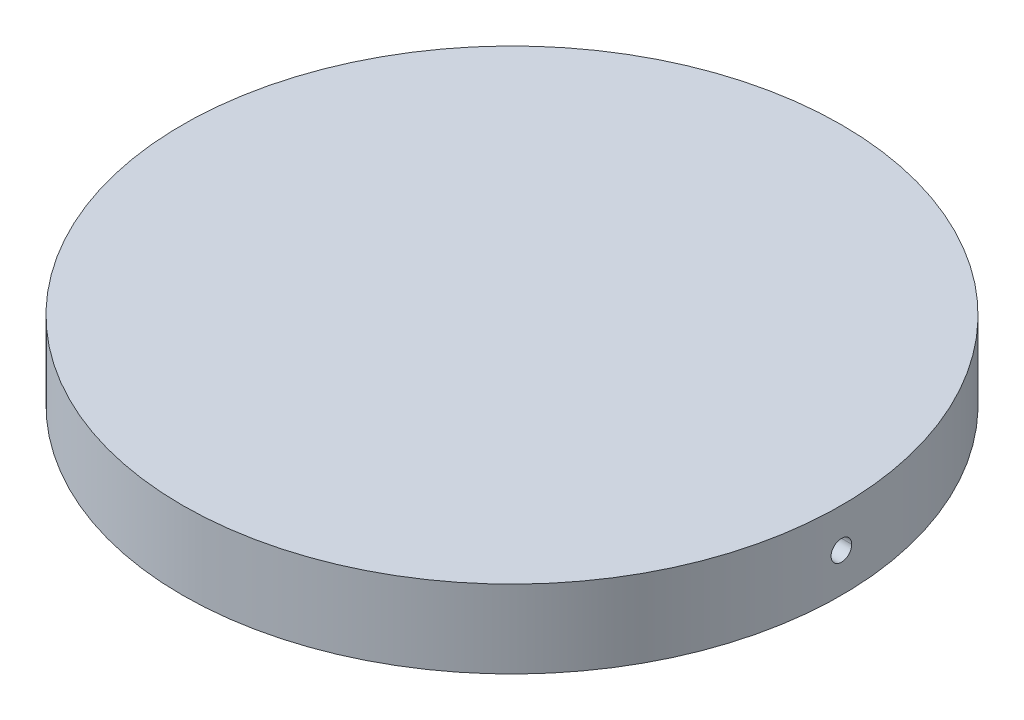
ISO-10303-21;
HEADER;
FILE_DESCRIPTION(('STEP AP214'),'2;1');
FILE_NAME('part.step','',(''),(''),'','','');
FILE_SCHEMA(('AUTOMOTIVE_DESIGN { 1 0 10303 214 1 1 1 1 }'));
ENDSEC;
DATA;
#1=APPLICATION_CONTEXT('core data for automotive mechanical design processes');
#2=APPLICATION_PROTOCOL_DEFINITION('international standard','automotive_design',2000,#1);
#3=PRODUCT_CONTEXT('',#1,'mechanical');
#4=PRODUCT('Part','Part','',(#3));
#5=PRODUCT_RELATED_PRODUCT_CATEGORY('part','',(#4));
#6=PRODUCT_DEFINITION_FORMATION('','',#4);
#7=PRODUCT_DEFINITION_CONTEXT('part definition',#1,'design');
#8=PRODUCT_DEFINITION('design','',#6,#7);
#9=PRODUCT_DEFINITION_SHAPE('','',#8);
#10=(LENGTH_UNIT() NAMED_UNIT(*) SI_UNIT(.MILLI.,.METRE.));
#11=(NAMED_UNIT(*) PLANE_ANGLE_UNIT() SI_UNIT($,.RADIAN.));
#12=(NAMED_UNIT(*) SI_UNIT($,.STERADIAN.) SOLID_ANGLE_UNIT());
#13=UNCERTAINTY_MEASURE_WITH_UNIT(LENGTH_MEASURE(1.E-05),#10,'distance_accuracy_value','');
#14=(GEOMETRIC_REPRESENTATION_CONTEXT(3) GLOBAL_UNCERTAINTY_ASSIGNED_CONTEXT((#13)) GLOBAL_UNIT_ASSIGNED_CONTEXT((#10,
#11,#12)) REPRESENTATION_CONTEXT('',''));
#15=CARTESIAN_POINT('',(0.,0.,0.));
#16=DIRECTION('',(0.,0.,1.));
#17=DIRECTION('',(1.,0.,0.));
#18=AXIS2_PLACEMENT_3D('',#15,#16,#17);
#19=CARTESIAN_POINT('',(12.7,7.606551128,0.));
#20=DIRECTION('',(0.,-1.,0.));
#21=DIRECTION('',(1.,0.,0.));
#22=AXIS2_PLACEMENT_3D('',#19,#20,#21);
#23=CYLINDRICAL_SURFACE('',#22,50.8);
#24=CARTESIAN_POINT('',(-38.0751909290542,6.00056940736033,1.58744641424879));
#25=CARTESIAN_POINT('',(-38.0751900585185,5.95591924779418,1.58746340135656));
#26=CARTESIAN_POINT('',(-38.075248819807,5.91128976092665,1.58559597276022));
#27=CARTESIAN_POINT('',(-38.0754821181188,5.82234888457599,1.57811165859868));
#28=CARTESIAN_POINT('',(-38.0756566493904,5.77803747940012,1.57249495930881));
#29=CARTESIAN_POINT('',(-38.0763479300891,5.64613110276851,1.55007392236804));
#30=CARTESIAN_POINT('',(-38.0770323867037,5.55941785487588,1.52769855641127));
#31=CARTESIAN_POINT('',(-38.0787725083873,5.39098483822894,1.46871464950783));
#32=CARTESIAN_POINT('',(-38.0798283424716,5.30926736297704,1.43209962724265));
#33=CARTESIAN_POINT('',(-38.0821917895835,5.15314259667142,1.34568129167991));
#34=CARTESIAN_POINT('',(-38.0834993550029,5.07873392736502,1.29588047145552));
#35=CARTESIAN_POINT('',(-38.0862195509659,4.93930995514943,1.18448267866127));
#36=CARTESIAN_POINT('',(-38.0876322156291,4.87429772304661,1.12288186501475));
#37=CARTESIAN_POINT('',(-38.090403260518,4.75552522391951,0.989630573851511));
#38=CARTESIAN_POINT('',(-38.0917616324457,4.7017666716213,0.917978567605816));
#39=CARTESIAN_POINT('',(-38.0942709801728,4.60703300606265,0.766651369601128));
#40=CARTESIAN_POINT('',(-38.0954219224862,4.56605995602277,0.686974885658298));
#41=CARTESIAN_POINT('',(-38.0973862993972,4.49807583188354,0.521874813353642));
#42=CARTESIAN_POINT('',(-38.0981997562586,4.47106383674918,0.436451604533537));
#43=CARTESIAN_POINT('',(-38.0993973470415,4.43177291796812,0.262306464328654));
#44=CARTESIAN_POINT('',(-38.0997816140124,4.41948942838551,0.173585564048473));
#45=CARTESIAN_POINT('',(-38.1000779568643,4.40999005613285,-0.00466197737175226));
#46=CARTESIAN_POINT('',(-38.0999900230184,4.41277448385107,-0.0941886350718949));
#47=CARTESIAN_POINT('',(-38.0993519704751,4.43332858800722,-0.271470343358425));
#48=CARTESIAN_POINT('',(-38.098802018006,4.45109287489788,-0.359226019493863));
#49=CARTESIAN_POINT('',(-38.097302101488,4.50109403484533,-0.530508627312229));
#50=CARTESIAN_POINT('',(-38.096352138269,4.53333087787783,-0.614035567767554));
#51=CARTESIAN_POINT('',(-38.0941589542333,4.61136893559563,-0.77450898229184));
#52=CARTESIAN_POINT('',(-38.0929156740951,4.65717289462597,-0.851454120937065));
#53=CARTESIAN_POINT('',(-38.0902760474102,4.76104074561996,-0.996560943308238));
#54=CARTESIAN_POINT('',(-38.0888797078499,4.81910407812122,-1.06472302762459));
#55=CARTESIAN_POINT('',(-38.0860907401809,4.94586339646807,-1.19035534964623));
#56=CARTESIAN_POINT('',(-38.0846981132851,5.01456250595847,-1.24782243535993));
#57=CARTESIAN_POINT('',(-38.0820735344925,5.16066240553603,-1.35042640851576));
#58=CARTESIAN_POINT('',(-38.0808416333816,5.23806593172353,-1.39555940354725));
#59=CARTESIAN_POINT('',(-38.078677319693,5.39938913015483,-1.47221151271816));
#60=CARTESIAN_POINT('',(-38.0777450922014,5.48331278982382,-1.50372221751249));
#61=CARTESIAN_POINT('',(-38.0762878194112,5.65519786341699,-1.55215727164181));
#62=CARTESIAN_POINT('',(-38.0757621546945,5.74315291786559,-1.56910381458254));
#63=CARTESIAN_POINT('',(-38.0753755396687,5.85974734480052,-1.58153135898569));
#64=CARTESIAN_POINT('',(-38.0753058895327,5.88777547495679,-1.58376531958047));
#65=CARTESIAN_POINT('',(-38.0752130507354,5.94386437461089,-1.58673983982125));
#66=CARTESIAN_POINT('',(-38.0751897852135,5.97192501289248,-1.58748286999909));
#67=CARTESIAN_POINT('',(-38.0751897623787,5.99999729523695,-1.58748373044656));
#68=B_SPLINE_CURVE_WITH_KNOTS('',3,(#24,#25,#26,#27,#28,#29,#30,#31,#32,#33,#34,#35,#36,#37,#38,
#39,#40,#41,#42,#43,#44,#45,#46,#47,#48,#49,#50,#51,#52,#53,#54,#55,#56,#57,#58,#59,#60,#61,#62,
#63,#64,#65,#66,#67),.UNSPECIFIED.,.F.,.F.,(4,2,2,2,2,2,2,2,2,2,2,2,2,2,2,2,2,2,2,2,2,4),(0.,
0.133868178796989,0.267729707105143,0.535019999168647,0.802432093673216,1.06979366393697,
1.33724241279178,1.60473188326651,1.87226449672452,2.13977945833837,2.4072114670535,
2.67464898469677,2.94199032303325,3.20933110675468,3.47672600492289,3.74410870303281,
4.01157007885107,4.27911576331213,4.54682637468985,4.81412830807478,4.8984518156345,
4.98263547996859),.UNSPECIFIED.);
#69=CARTESIAN_POINT('',(-38.0751949719159,6.00056940833788,1.58744906791431));
#70=VERTEX_POINT('',#69);
#71=CARTESIAN_POINT('',(-38.0751894837319,5.99999729486621,-1.58748400761627));
#72=VERTEX_POINT('',#71);
#73=EDGE_CURVE('E121',#70,#72,#68,.T.);
#74=ORIENTED_EDGE('',*,*,#73,.F.);
#75=CARTESIAN_POINT('',(-38.0751897453393,5.99999729485935,-1.58748427544658));
#76=CARTESIAN_POINT('',(-38.0751893778954,6.04464758712235,-1.58748517092355));
#77=CARTESIAN_POINT('',(-38.075248643629,6.08927652677053,-1.58560165210028));
#78=CARTESIAN_POINT('',(-38.0754829397681,6.1782149549185,-1.57808526043562));
#79=CARTESIAN_POINT('',(-38.075657964422,6.22252445917907,-1.57245257387406));
#80=CARTESIAN_POINT('',(-38.076350686543,6.35442312033707,-1.5499839286689));
#81=CARTESIAN_POINT('',(-38.0770360541879,6.44112854119426,-1.52757724260858));
#82=CARTESIAN_POINT('',(-38.0787777955324,6.6095407552495,-1.46853245353917));
#83=CARTESIAN_POINT('',(-38.0798343381506,6.69124525265819,-1.43188787018034));
#84=CARTESIAN_POINT('',(-38.0821989221843,6.84733928844364,-1.34541300730348));
#85=CARTESIAN_POINT('',(-38.0835069160451,6.92173020595897,-1.29558522033912));
#86=CARTESIAN_POINT('',(-38.0862276435986,7.06111440264217,-1.18413683616334));
#87=CARTESIAN_POINT('',(-38.0876404113152,7.12610460867162,-1.12251239779638));
#88=CARTESIAN_POINT('',(-38.0904113284325,7.24482939587818,-0.989217877335405));
#89=CARTESIAN_POINT('',(-38.0917694694845,7.29856226182281,-0.917546267169794));
#90=CARTESIAN_POINT('',(-38.0942780506316,7.3932415916547,-0.766184482696691));
#91=CARTESIAN_POINT('',(-38.0954284573034,7.43418599872302,-0.686493021246849));
#92=CARTESIAN_POINT('',(-38.097391523819,7.50211072900084,-0.521368016468653));
#93=CARTESIAN_POINT('',(-38.0982042059428,7.52909197340155,-0.4359348523577));
#94=CARTESIAN_POINT('',(-38.0994001002624,7.56832015610289,-0.261775146878376));
#95=CARTESIAN_POINT('',(-38.0997834457251,7.58057166662578,-0.173049636299685));
#96=CARTESIAN_POINT('',(-38.1000779078492,7.59000676671905,0.00520168582282082));
#97=CARTESIAN_POINT('',(-38.0999890147897,7.58719004611181,0.0947275138031959));
#98=CARTESIAN_POINT('',(-38.0993491195269,7.56657197154118,0.272002179810747));
#99=CARTESIAN_POINT('',(-38.0987982833791,7.54877600218782,0.359751644783529));
#100=CARTESIAN_POINT('',(-38.0972967789571,7.49871297187023,0.531016611016644));
#101=CARTESIAN_POINT('',(-38.096346111469,7.46644593936263,0.614532120602485));
#102=CARTESIAN_POINT('',(-38.0941517812862,7.38834981608639,0.774977830946134));
#103=CARTESIAN_POINT('',(-38.092908059102,7.34251797121073,0.851906690302023));
#104=CARTESIAN_POINT('',(-38.0902678662238,7.23859749287618,0.996976467194709));
#105=CARTESIAN_POINT('',(-38.0888714025784,7.18050942488942,1.06511778993333));
#106=CARTESIAN_POINT('',(-38.0860825232696,7.05370451982573,1.19070466934683));
#107=CARTESIAN_POINT('',(-38.0846901089137,6.98498456991688,1.24814708267525));
#108=CARTESIAN_POINT('',(-38.0820662671471,6.83884725502513,1.35069867120581));
#109=CARTESIAN_POINT('',(-38.0808348909561,6.76142713735432,1.39580392740717));
#110=CARTESIAN_POINT('',(-38.0786718846783,6.60007551237815,1.47239820947198));
#111=CARTESIAN_POINT('',(-38.0777404404887,6.51614000668513,1.50387879492999));
#112=CARTESIAN_POINT('',(-38.0762849129933,6.34423692431069,1.5522518582151));
#113=CARTESIAN_POINT('',(-38.0757602069073,6.25627573119067,1.56916664299605));
#114=CARTESIAN_POINT('',(-38.075375521643,6.13986715676128,1.58153189666837));
#115=CARTESIAN_POINT('',(-38.0753065021592,6.11202913252193,1.58374566298647));
#116=CARTESIAN_POINT('',(-38.0752142954912,6.05632105275694,1.58670000430366));
#117=CARTESIAN_POINT('',(-38.0751910327289,6.02845112625979,1.5874430086269));
#118=CARTESIAN_POINT('',(-38.0751906945965,6.0005694100009,1.58745391346005));
#119=B_SPLINE_CURVE_WITH_KNOTS('',3,(#75,#76,#77,#78,#79,#80,#81,#82,#83,#84,#85,#86,#87,#88,
#89,#90,#91,#92,#93,#94,#95,#96,#97,#98,#99,#100,#101,#102,#103,#104,#105,#106,#107,#108,#109,
#110,#111,#112,#113,#114,#115,#116,#117,#118),.UNSPECIFIED.,.F.,.F.,(4,2,2,2,2,2,2,2,2,2,2,2,2,
2,2,2,2,2,2,2,2,4),(0.,0.133868566856858,0.267730482863573,0.535021549459192,0.802434415817713,
1.06979675840348,1.33724630646569,1.60473657507669,1.87226984308955,2.13978545888933,
2.40721801433531,2.67465607486766,2.94199804012864,3.20933947967695,3.47673523568703,
3.7441186574079,4.01158051305785,4.27912723178262,4.54683945774685,4.81414096003585,
4.89789181972344,4.98150422850908),.UNSPECIFIED.);
#120=EDGE_CURVE('E123',#72,#70,#119,.T.);
#121=ORIENTED_EDGE('',*,*,#120,.F.);
#122=EDGE_LOOP('',(#74,#121));
#123=FACE_BOUND('',#122,.T.);
#124=ADVANCED_FACE('F17',(#123),#23,.T.);
#125=CARTESIAN_POINT('',(-12.7,7.6065612056119,0.));
#126=DIRECTION('',(0.,-1.,0.));
#127=DIRECTION('',(0.,0.,-1.));
#128=AXIS2_PLACEMENT_3D('',#125,#126,#127);
#129=CYLINDRICAL_SURFACE('',#128,50.8);
#130=CARTESIAN_POINT('',(38.0751897560507,6.00002217674057,1.58748393284521));
#131=CARTESIAN_POINT('',(38.0751894059754,6.0446723551502,1.58748427285173));
#132=CARTESIAN_POINT('',(38.0752486889027,6.08930115753162,1.58560020360341));
#133=CARTESIAN_POINT('',(38.0754830186217,6.17823926526298,1.57808272458439));
#134=CARTESIAN_POINT('',(38.0756580596619,6.22254858637603,1.57244950109318));
#135=CARTESIAN_POINT('',(38.0763508289955,6.35444663128025,1.54997927208544));
#136=CARTESIAN_POINT('',(38.0770362255796,6.4411515519084,1.52757156432102));
#137=CARTESIAN_POINT('',(38.0787780165634,6.60956260106108,1.46852483027927));
#138=CARTESIAN_POINT('',(38.0798345798779,6.69126643372268,1.43187932370077));
#139=CARTESIAN_POINT('',(38.082199194964,6.84735899463586,1.34540273890996));
#140=CARTESIAN_POINT('',(38.0835071991831,6.92174910204908,1.29557415321978));
#141=CARTESIAN_POINT('',(38.0862279362621,7.06113155593076,1.18412431826789));
#142=CARTESIAN_POINT('',(38.0876407031425,7.12612082919434,1.12249922786549));
#143=CARTESIAN_POINT('',(38.0904116078575,7.24484365434318,0.989203568816823));
#144=CARTESIAN_POINT('',(38.0917697373419,7.29857549099116,0.917531472132948));
#145=CARTESIAN_POINT('',(38.0942782863401,7.39325269393727,0.766168895365366));
#146=CARTESIAN_POINT('',(38.0954286724328,7.43419600362852,0.686477128307655));
#147=CARTESIAN_POINT('',(38.0973916916178,7.5021185033926,0.521351701013395));
#148=CARTESIAN_POINT('',(38.0982043469909,7.52909861467347,0.435918419987761));
#149=CARTESIAN_POINT('',(38.0994001851789,7.56832452751365,0.261758674465493));
#150=CARTESIAN_POINT('',(38.09978350127,7.58057490158915,0.173033240764935));
#151=CARTESIAN_POINT('',(38.1000779059064,7.59000775821689,-0.00521773924232872));
#152=CARTESIAN_POINT('',(38.099988984723,7.58718993034246,-0.094743301994911));
#153=CARTESIAN_POINT('',(38.0993490381657,7.5665697014185,-0.272017260463798));
#154=CARTESIAN_POINT('',(38.0987981788196,7.54877268411676,-0.35976628309328));
#155=CARTESIAN_POINT('',(38.0972966361458,7.49870764901997,-0.531030185999936));
#156=CARTESIAN_POINT('',(38.0963459536454,7.46643966116265,-0.614545075036342));
#157=CARTESIAN_POINT('',(38.0941516039746,7.38834175210409,-0.774989378856817));
#158=CARTESIAN_POINT('',(38.0929078773693,7.34250907923369,-0.851917453383995));
#159=CARTESIAN_POINT('',(38.0902676863655,7.23858706641015,-0.996985570898472));
#160=CARTESIAN_POINT('',(38.08887122894,7.18049828588885,-1.06512601476981));
#161=CARTESIAN_POINT('',(38.0860823719871,7.05369205755473,-1.19071107497247));
#162=CARTESIAN_POINT('',(38.0846899737741,6.98497148881081,-1.24815253970182));
#163=CARTESIAN_POINT('',(38.0820661769658,6.83883326038768,-1.35070202003112));
#164=CARTESIAN_POINT('',(38.0808348292639,6.76141286578344,-1.39580614180721));
#165=CARTESIAN_POINT('',(38.0786718886263,6.60006105466413,-1.47239803971517));
#166=CARTESIAN_POINT('',(38.0777404807633,6.51612565766241,-1.50387741303477));
#167=CARTESIAN_POINT('',(38.0762850213733,6.34422256550315,-1.55224830043223));
#168=CARTESIAN_POINT('',(38.0757603501067,6.25626122208779,-1.56916201240498));
#169=CARTESIAN_POINT('',(38.0753750928506,6.13966559192947,-1.58154568340952));
#170=CARTESIAN_POINT('',(38.0753057742402,6.1116400346466,-1.58376900560969));
#171=CARTESIAN_POINT('',(38.0752135892311,6.05555683981397,-1.58672259866644));
#172=CARTESIAN_POINT('',(38.0751906459902,6.02749933253496,-1.58745533937061));
#173=CARTESIAN_POINT('',(38.0751909393071,5.99943045091416,-1.58744608629906));
#174=B_SPLINE_CURVE_WITH_KNOTS('',3,(#130,#131,#132,#133,#134,#135,#136,#137,#138,#139,#140,
#141,#142,#143,#144,#145,#146,#147,#148,#149,#150,#151,#152,#153,#154,#155,#156,#157,#158,#159,
#160,#161,#162,#163,#164,#165,#166,#167,#168,#169,#170,#171,#172,#173),.UNSPECIFIED.,.F.,.F.,(4,
2,2,2,2,2,2,2,2,2,2,2,2,2,2,2,2,2,2,2,2,4),(0.,0.133868225479692,0.267729800114867,
0.53502018488514,0.802432369041878,1.0697940297174,1.33724289639863,1.60473248329037,
1.8722650648147,2.13977999389396,2.40721185751217,2.674649230633,2.94199052373312,
3.20933126375666,3.47672627249857,3.74410907859536,4.01157052360165,4.27911628572769,
4.54682681745968,4.81412863584237,4.89844192904701,4.98261540355422),.UNSPECIFIED.);
#175=CARTESIAN_POINT('',(38.0751898227204,6.00002217673813,1.5874841095571));
#176=VERTEX_POINT('',#175);
#177=CARTESIAN_POINT('',(38.0751948252608,5.99943044989101,-1.58744885417735));
#178=VERTEX_POINT('',#177);
#179=EDGE_CURVE('E86',#176,#178,#174,.T.);
#180=ORIENTED_EDGE('',*,*,#179,.F.);
#181=CARTESIAN_POINT('',(38.0751906952858,5.99943044816505,-1.5874538914131));
#182=CARTESIAN_POINT('',(38.0751908310659,5.95478014053231,-1.58743869120175));
#183=CARTESIAN_POINT('',(38.0752505986689,5.91015186554544,-1.58553908300143));
#184=CARTESIAN_POINT('',(38.0754858821087,5.82121611997089,-1.57799062531259));
#185=CARTESIAN_POINT('',(38.0756613921943,5.77690863355442,-1.57234196210747));
#186=CARTESIAN_POINT('',(38.0763555239195,5.64501803636058,-1.54982575507474));
#187=CARTESIAN_POINT('',(38.0770417707606,5.55832067226077,-1.52738779925939));
#188=CARTESIAN_POINT('',(38.0787850480427,5.38992970830517,-1.46828226595392));
#189=CARTESIAN_POINT('',(38.0798422472968,5.30823840652385,-1.43160820908926));
#190=CARTESIAN_POINT('',(38.0822078463666,5.1521755189868,-1.34507702866756));
#191=CARTESIAN_POINT('',(38.0835161986844,5.07780255321015,-1.29522239713788));
#192=CARTESIAN_POINT('',(38.0862373022913,4.93845851059335,-1.18372369848512));
#193=CARTESIAN_POINT('',(38.0876500875006,4.87349050898379,-1.12207579042969));
#194=CARTESIAN_POINT('',(38.0904206932689,4.75481376207026,-0.988738378256718));
#195=CARTESIAN_POINT('',(38.0917785054267,4.70110673249107,-0.917047346737802));
#196=CARTESIAN_POINT('',(38.0942861148692,4.60648200757359,-0.765651366165082));
#197=CARTESIAN_POINT('',(38.0954358787993,4.56556636220237,-0.685945135285433));
#198=CARTESIAN_POINT('',(38.0973974153094,4.49770122648831,-0.520795631663674));
#199=CARTESIAN_POINT('',(38.0982092101862,4.47075081478556,-0.435352737819623));
#200=CARTESIAN_POINT('',(38.0994031812412,4.43158549293618,-0.261178930221962));
#201=CARTESIAN_POINT('',(38.0997854909092,4.41936600413079,-0.172449046971713));
#202=CARTESIAN_POINT('',(38.1000778453874,4.40999522027072,0.00580557774714265));
#203=CARTESIAN_POINT('',(38.0999878804745,4.41284423544171,0.0953303355425001));
#204=CARTESIAN_POINT('',(38.0993459220469,4.43352624363747,0.272597487805323));
#205=CARTESIAN_POINT('',(38.0987940943787,4.4513538581317,0.360340510478826));
#206=CARTESIAN_POINT('',(38.0972907940262,4.50147864357114,0.531587372707447));
#207=CARTESIAN_POINT('',(38.0963393221269,4.53377578609576,0.615091220588656));
#208=CARTESIAN_POINT('',(38.0941436557269,4.61192977109221,0.775508768541391));
#209=CARTESIAN_POINT('',(38.0928994016205,4.65778937514814,0.852421122337199));
#210=CARTESIAN_POINT('',(38.0902584741661,4.76176221399162,0.997453464972865));
#211=CARTESIAN_POINT('',(38.0888618078503,4.81987488354603,1.06557385915167));
#212=CARTESIAN_POINT('',(38.0860728721197,4.94672513969897,1.19111503517263));
#213=CARTESIAN_POINT('',(38.0846806041144,5.01546583688191,1.24853267367297));
#214=CARTESIAN_POINT('',(38.0820573851221,5.16164020347839,1.35103156525602));
#215=CARTESIAN_POINT('',(38.0808264854532,5.23907662382656,1.3961088988304));
#216=CARTESIAN_POINT('',(38.0786647074695,5.4004558913762,1.47264494957715));
#217=CARTESIAN_POINT('',(38.0777340150144,5.48440272947291,1.50409523429866));
#218=CARTESIAN_POINT('',(38.0762801780606,5.65632321528267,1.55240625229145));
#219=CARTESIAN_POINT('',(38.075756410545,5.74429048803016,1.56928929294073));
#220=CARTESIAN_POINT('',(38.0753729987804,5.86070662293988,1.58161287259628));
#221=CARTESIAN_POINT('',(38.0753042842252,5.888548579945,1.58381675938191));
#222=CARTESIAN_POINT('',(38.0752127016156,5.94426399415675,1.58675099919404));
#223=CARTESIAN_POINT('',(38.0751897579548,5.97213732319088,1.58748378227095));
#224=CARTESIAN_POINT('',(38.0751897446713,6.00002217083787,1.58748429681317));
#225=B_SPLINE_CURVE_WITH_KNOTS('',3,(#181,#182,#183,#184,#185,#186,#187,#188,#189,#190,#191,
#192,#193,#194,#195,#196,#197,#198,#199,#200,#201,#202,#203,#204,#205,#206,#207,#208,#209,#210,
#211,#212,#213,#214,#215,#216,#217,#218,#219,#220,#221,#222,#223,#224),.UNSPECIFIED.,.F.,.F.,(4,
2,2,2,2,2,2,2,2,2,2,2,2,2,2,2,2,2,2,2,2,4),(0.,0.13386862056266,0.26773058994721,
0.535021763727859,0.802434734486708,1.06979718207244,1.33724685518951,1.60473724744916,
1.87227048618449,2.13978607209711,2.40721848748111,2.6746564087022,2.9419983390669,
3.20933974432951,3.47673562308801,3.74411916958894,4.01158112189449,4.27912792674466,
4.54684005458097,4.81414149329203,4.89790175676134,4.98152354617611),.UNSPECIFIED.);
#226=EDGE_CURVE('E195',#178,#176,#225,.T.);
#227=ORIENTED_EDGE('',*,*,#226,.F.);
#228=EDGE_LOOP('',(#180,#227));
#229=FACE_BOUND('',#228,.T.);
#230=ADVANCED_FACE('F127',(#229),#129,.T.);
#231=CARTESIAN_POINT('',(-50.876353679459,6.000039213,-1.5137000000014E-05));
#232=DIRECTION('',(1.,0.,0.));
#233=DIRECTION('',(0.,0.,-1.));
#234=AXIS2_PLACEMENT_3D('',#231,#232,#233);
#235=CYLINDRICAL_SURFACE('',#234,1.587469139);
#236=ORIENTED_EDGE('',*,*,#120,.T.);
#237=CARTESIAN_POINT('',(-38.0751947530953,6.00118342825574,1.58745358963648));
#238=DIRECTION('',(-1.,0.,0.));
#239=VECTOR('',#238,1.);
#240=LINE('',#237,#239);
#241=CARTESIAN_POINT('',(-50.7751915389103,6.00118342737413,1.58745005109841));
#242=VERTEX_POINT('',#241);
#243=EDGE_CURVE('E180',#70,#242,#240,.T.);
#244=ORIENTED_EDGE('',*,*,#243,.T.);
#245=CARTESIAN_POINT('',(-50.7751893403756,6.00118342895956,1.58745218197116));
#246=CARTESIAN_POINT('',(-50.7751908775814,6.04583380186475,1.58742060258737));
#247=CARTESIAN_POINT('',(-50.7752515499253,6.09046139123707,1.58550410850129));
#248=CARTESIAN_POINT('',(-50.7754881727988,6.17939427463164,1.57792152990007));
#249=CARTESIAN_POINT('',(-50.7756641175505,6.22369958469516,1.57225563331825));
#250=CARTESIAN_POINT('',(-50.7763596315567,6.35558146328945,1.5496882578076));
#251=CARTESIAN_POINT('',(-50.7770469054495,6.44227013431349,1.5272168412393));
#252=CARTESIAN_POINT('',(-50.7787919181048,6.61063823321062,1.46804622518507));
#253=CARTESIAN_POINT('',(-50.7798498256611,6.6923153587802,1.43134054232697));
#254=CARTESIAN_POINT('',(-50.7822165537261,6.84834480705923,1.3447489530742));
#255=CARTESIAN_POINT('',(-50.7835253268315,6.92269850958222,1.29486553605626));
#256=CARTESIAN_POINT('',(-50.7862469074593,7.0619994651063,1.18331288132641));
#257=CARTESIAN_POINT('',(-50.7876597487897,7.1269436407802,1.12163980310529));
#258=CARTESIAN_POINT('',(-50.7904301033412,7.24556883657843,0.988256400541319));
#259=CARTESIAN_POINT('',(-50.7917876081107,7.29924814134858,0.916544550315659));
#260=CARTESIAN_POINT('',(-50.7942942709055,7.39381427649412,0.765111914954701));
#261=CARTESIAN_POINT('',(-50.7954433956424,7.43469906372433,0.685389853358367));
#262=CARTESIAN_POINT('',(-50.7974033954959,7.50250026476896,0.520214092997321));
#263=CARTESIAN_POINT('',(-50.7982142929171,7.52941759970517,0.434760772615933));
#264=CARTESIAN_POINT('',(-50.7994063117745,7.56851548710387,0.260571858907449));
#265=CARTESIAN_POINT('',(-50.7997875669402,7.58070062516268,0.171837295779028));
#266=CARTESIAN_POINT('',(-50.8000777745015,7.590002416216,-0.00642084884914089));
#267=CARTESIAN_POINT('',(-50.7999867171806,7.58711875921681,-0.0959444465430051));
#268=CARTESIAN_POINT('',(-50.7993426594647,7.56636817268168,-0.273203511980625));
#269=CARTESIAN_POINT('',(-50.7987898247083,7.54850661568298,-0.360939609339513));
#270=CARTESIAN_POINT('',(-50.7972847083868,7.49831559302075,-0.532167028509511));
#271=CARTESIAN_POINT('',(-50.7963324275805,7.46598615484034,-0.615658358383623));
#272=CARTESIAN_POINT('',(-50.794135431623,7.38777010545327,-0.77604568756872));
#273=CARTESIAN_POINT('',(-50.7928906567135,7.34188072336538,-0.852940334745098));
#274=CARTESIAN_POINT('',(-50.7902490356879,7.23785172886103,-0.997932497151092));
#275=CARTESIAN_POINT('',(-50.7888521966304,7.17971268494477,-1.06603042039542));
#276=CARTESIAN_POINT('',(-50.7860632835141,7.05281384844627,-1.19152250421847));
#277=CARTESIAN_POINT('',(-50.7846712109694,6.98405095253422,-1.24891352635972));
#278=CARTESIAN_POINT('',(-50.7820487270734,6.83783686933551,-1.35135588925138));
#279=CARTESIAN_POINT('',(-50.7808183673358,6.76038292268437,-1.39640329525253));
#280=CARTESIAN_POINT('',(-50.7786579544044,6.59897382141841,-1.47287697373439));
#281=CARTESIAN_POINT('',(-50.7777280875083,6.51501467358198,-1.50429480035302));
#282=CARTESIAN_POINT('',(-50.7762760971423,6.34307545760019,-1.55253920374267));
#283=CARTESIAN_POINT('',(-50.77575334864,6.25510177352756,-1.56938815193085));
#284=CARTESIAN_POINT('',(-50.7753716690745,6.13878645661255,-1.58165552824304));
#285=CARTESIAN_POINT('',(-50.7753034621147,6.11104940657377,-1.58384310163776));
#286=CARTESIAN_POINT('',(-50.7752125499997,6.05554441002121,-1.58675584436662));
#287=CARTESIAN_POINT('',(-50.7751897699406,6.02777659003258,-1.58748342109032));
#288=CARTESIAN_POINT('',(-50.7751897453393,5.99999730799729,-1.58748427544691));
#289=B_SPLINE_CURVE_WITH_KNOTS('',3,(#245,#246,#247,#248,#249,#250,#251,#252,#253,#254,#255,
#256,#257,#258,#259,#260,#261,#262,#263,#264,#265,#266,#267,#268,#269,#270,#271,#272,#273,#274,
#275,#276,#277,#278,#279,#280,#281,#282,#283,#284,#285,#286,#287,#288),.UNSPECIFIED.,.F.,.F.,(4,
2,2,2,2,2,2,2,2,2,2,2,2,2,2,2,2,2,2,2,2,4),(0.,0.133868732857255,0.267730756248488,
0.53502192304175,0.802434977913951,1.0697975524544,1.33724736983897,1.60473788354443,
1.87227109080187,2.13978665260845,2.40721892510903,2.67465669922039,2.94199858505007,
3.20933996304074,3.47673600822504,3.74411964643529,4.01158153817935,4.27912858928194,
4.54684119567118,4.81414197895249,4.89758501476171,4.98089034785674),.UNSPECIFIED.);
#290=CARTESIAN_POINT('',(-50.7751897545316,5.99999729383268,-1.58748399776918));
#291=VERTEX_POINT('',#290);
#292=EDGE_CURVE('E73',#242,#291,#289,.T.);
#293=ORIENTED_EDGE('',*,*,#292,.T.);
#294=DIRECTION('',(1.,0.,0.));
#295=VECTOR('',#294,1.);
#296=CARTESIAN_POINT('',(-50.8763519802995,5.99995537700001,-1.587483731));
#297=LINE('',#296,#295);
#298=EDGE_CURVE('E81',#72,#291,#297,.F.);
#299=ORIENTED_EDGE('',*,*,#298,.F.);
#300=EDGE_LOOP('',(#236,#244,#293,#299));
#301=FACE_BOUND('',#300,.T.);
#302=ADVANCED_FACE('F107',(#301),#235,.F.);
#303=CARTESIAN_POINT('',(-50.8763519802995,5.999955377,-1.85989999999499E-05));
#304=DIRECTION('',(1.,0.,0.));
#305=DIRECTION('',(0.,1.,0.));
#306=AXIS2_PLACEMENT_3D('',#303,#304,#305);
#307=CYLINDRICAL_SURFACE('',#306,1.587465132);
#308=ORIENTED_EDGE('',*,*,#73,.T.);
#309=ORIENTED_EDGE('',*,*,#298,.T.);
#310=CARTESIAN_POINT('',(-50.7751897623787,5.99999729382561,-1.58748373044661));
#311=CARTESIAN_POINT('',(-50.7751893949377,5.95534711425863,-1.58748462588731));
#312=CARTESIAN_POINT('',(-50.7752486605016,5.91071828725398,-1.58560111178367));
#313=CARTESIAN_POINT('',(-50.7754829559724,5.82178008358948,-1.57808473902108));
#314=CARTESIAN_POINT('',(-50.7756579801278,5.77747069116887,-1.57245206664147));
#315=CARTESIAN_POINT('',(-50.7763507002867,5.64557236296539,-1.54998347804693));
#316=CARTESIAN_POINT('',(-50.777036066001,5.55886716099552,-1.52757684848021));
#317=CARTESIAN_POINT('',(-50.7787778025812,5.39045537210066,-1.46853220832568));
#318=CARTESIAN_POINT('',(-50.7798343423652,5.30875108095959,-1.43188771740352));
#319=CARTESIAN_POINT('',(-50.7821989203596,5.15265743923837,-1.34541307268146));
#320=CARTESIAN_POINT('',(-50.7835069110153,5.07826670952487,-1.29558541142577));
#321=CARTESIAN_POINT('',(-50.7862276324326,4.93888286476102,-1.18413730845984));
#322=CARTESIAN_POINT('',(-50.787640397218,4.8738928228388,-1.12251302560691));
#323=CARTESIAN_POINT('',(-50.7904113094321,4.75516833546424,-0.989218841576515));
#324=CARTESIAN_POINT('',(-50.7917694485121,4.70143560523639,-0.917547412334561));
#325=CARTESIAN_POINT('',(-50.7942780273112,4.60675651449806,-0.766186009888534));
#326=CARTESIAN_POINT('',(-50.7954284336068,4.56581221081651,-0.686494749535865));
#327=CARTESIAN_POINT('',(-50.7973915014649,4.49788765209374,-0.521370161490757));
#328=CARTESIAN_POINT('',(-50.7982041853072,4.47090647585741,-0.435937213017322));
#329=CARTESIAN_POINT('',(-50.7994000854549,4.43167839232473,-0.261777947273456));
#330=CARTESIAN_POINT('',(-50.7997834350271,4.41942691279252,-0.173052660795769));
#331=CARTESIAN_POINT('',(-50.8000779078111,4.40999183655905,0.00519821181870873));
#332=CARTESIAN_POINT('',(-50.7999890212985,4.41280855015185,0.0947238143982321));
#333=CARTESIAN_POINT('',(-50.7993491413287,4.43342657329569,0.271998035913321));
#334=CARTESIAN_POINT('',(-50.7987983139168,4.45122249855769,0.359747281757108));
#335=CARTESIAN_POINT('',(-50.7972968287145,4.50128540370718,0.531011815980448));
#336=CARTESIAN_POINT('',(-50.7963461717296,4.53355235443808,0.614527112890293));
#337=CARTESIAN_POINT('',(-50.7941518637025,4.61164827577862,0.77497240715516));
#338=CARTESIAN_POINT('',(-50.7929081531989,4.65747999920346,0.851901063737444));
#339=CARTESIAN_POINT('',(-50.7902679835717,4.76140021261732,0.996970476312302));
#340=CARTESIAN_POINT('',(-50.7888715314611,4.81948813998287,1.06511163546541));
#341=CARTESIAN_POINT('',(-50.7860826739578,4.94629276444054,1.19069823529129));
#342=CARTESIAN_POINT('',(-50.784690269874,5.01501257820737,1.24814052873781));
#343=CARTESIAN_POINT('',(-50.7820664485417,5.16114952869038,1.35069184536367));
#344=CARTESIAN_POINT('',(-50.7808350823571,5.23856940973254,1.39579696144282));
#345=CARTESIAN_POINT('',(-50.7786720945839,5.39992046010564,1.47239096562458));
#346=CARTESIAN_POINT('',(-50.7777406585033,5.48385561949182,1.50387143094675));
#347=CARTESIAN_POINT('',(-50.7762851406133,5.65575819694751,1.55224441392721));
#348=CARTESIAN_POINT('',(-50.7757604374655,5.74371924634846,1.5691591870109));
#349=CARTESIAN_POINT('',(-50.7753754628558,5.86021580417988,1.58153379390372));
#350=CARTESIAN_POINT('',(-50.7753062972141,5.88814221172413,1.58375223630223));
#351=CARTESIAN_POINT('',(-50.7752140898194,5.94402709078233,1.58670658319009));
#352=CARTESIAN_POINT('',(-50.7751909718939,5.97198543266611,1.58744493607013));
#353=CARTESIAN_POINT('',(-50.7751909253413,5.9999553745,1.587446533));
#354=B_SPLINE_CURVE_WITH_KNOTS('',3,(#310,#311,#312,#313,#314,#315,#316,#317,#318,#319,#320,
#321,#322,#323,#324,#325,#326,#327,#328,#329,#330,#331,#332,#333,#334,#335,#336,#337,#338,#339,
#340,#341,#342,#343,#344,#345,#346,#347,#348,#349,#350,#351,#352,#353),.UNSPECIFIED.,.F.,.F.,(4,
2,2,2,2,2,2,2,2,2,2,2,2,2,2,2,2,2,2,2,2,4),(0.,0.133868228976613,0.267729807120167,
0.535020198990948,0.802432390335496,1.06979405809867,1.33724293104628,1.6047325243531,
1.87226511727057,2.13978005790034,2.40721193792921,2.67464932511106,2.94199062275177,
3.20933138174867,3.47672643173376,3.74410920956596,4.01157051811611,4.27911643202882,
4.54682750781091,4.81412880907551,4.89814478241792,4.98202165995832),.UNSPECIFIED.);
#355=CARTESIAN_POINT('',(-50.7751909228207,5.999955377,1.587446533));
#356=VERTEX_POINT('',#355);
#357=EDGE_CURVE('E72',#291,#356,#354,.T.);
#358=ORIENTED_EDGE('',*,*,#357,.T.);
#359=CARTESIAN_POINT('',(-50.7751909203,5.999955377,-1.8599E-05));
#360=DIRECTION('',(1.,0.,0.));
#361=DIRECTION('',(0.,0.,-1.));
#362=AXIS2_PLACEMENT_3D('',#359,#360,#361);
#363=CIRCLE('',#362,1.587465132);
#364=EDGE_CURVE('E69',#356,#242,#363,.F.);
#365=ORIENTED_EDGE('',*,*,#364,.T.);
#366=ORIENTED_EDGE('',*,*,#243,.F.);
#367=EDGE_LOOP('',(#308,#309,#358,#365,#366));
#368=FACE_BOUND('',#367,.T.);
#369=ADVANCED_FACE('F79',(#368),#307,.F.);
#370=CARTESIAN_POINT('',(37.998838554,5.999960786,1.51590000000345E-05));
#371=DIRECTION('',(1.,0.,0.));
#372=DIRECTION('',(0.,0.,-1.));
#373=AXIS2_PLACEMENT_3D('',#370,#371,#372);
#374=CYLINDRICAL_SURFACE('',#373,1.587469139);
#375=CARTESIAN_POINT('',(50.7751896573306,6.0000221749953,1.58748420669892));
#376=CARTESIAN_POINT('',(50.7751893279209,5.95537187981919,1.58748570662882));
#377=CARTESIAN_POINT('',(50.7752485999188,5.91074291546575,1.58560275915446));
#378=CARTESIAN_POINT('',(50.7754828799587,5.82180439435678,1.57808747622403));
#379=CARTESIAN_POINT('',(50.7756578822475,5.77749482183393,1.57245532715301));
#380=CARTESIAN_POINT('',(50.7763505467455,5.64559588956327,1.54998829059173));
#381=CARTESIAN_POINT('',(50.7770358885026,5.55889019706962,1.52758267360005));
#382=CARTESIAN_POINT('',(50.7787775796577,5.3904772630076,1.46853995586242));
#383=CARTESIAN_POINT('',(50.7798340979835,5.30877231726427,1.43189637441095));
#384=CARTESIAN_POINT('',(50.7821986448535,5.15267722201266,1.3454234271882));
#385=CARTESIAN_POINT('',(50.7835066258433,5.07828569346751,1.29559655385864));
#386=CARTESIAN_POINT('',(50.7862273386067,4.9389001303258,1.18414988173635));
#387=CARTESIAN_POINT('',(50.7876401044073,4.87390916877663,1.12252624180517));
#388=CARTESIAN_POINT('',(50.7904110293804,4.75518274728567,0.989233180897166));
#389=CARTESIAN_POINT('',(50.7917691802063,4.70144900250597,0.917562231873735));
#390=CARTESIAN_POINT('',(50.7942777913975,4.60676781512401,0.766201611558328));
#391=CARTESIAN_POINT('',(50.795428218337,4.56582242958197,0.686510652937879));
#392=CARTESIAN_POINT('',(50.7973913336086,4.49789567173047,0.521386482173185));
#393=CARTESIAN_POINT('',(50.7982040442194,4.47091337826899,0.435953649243437));
#394=CARTESIAN_POINT('',(50.7994000005129,4.43168305669551,0.261794423552848));
#395=CARTESIAN_POINT('',(50.7997833794534,4.41943045663008,0.173069061580112));
#396=CARTESIAN_POINT('',(50.8000779097439,4.40999316830811,-0.00518214767602052));
#397=CARTESIAN_POINT('',(50.7999890513773,4.41280879008735,-0.0947080113922822));
#398=CARTESIAN_POINT('',(50.7993492228115,4.43342468887015,-0.27198292975096));
#399=CARTESIAN_POINT('',(50.7987984186852,4.45121958072601,-0.359732611334538));
#400=CARTESIAN_POINT('',(50.7972969720057,4.50128050887265,-0.530998193362476));
#401=CARTESIAN_POINT('',(50.7963463302171,4.53354651749292,-0.614514101901985));
#402=CARTESIAN_POINT('',(50.7941520421611,4.61164067786548,-0.774960782785373));
#403=CARTESIAN_POINT('',(50.7929083363778,4.65747158487581,-0.851890213208531));
#404=CARTESIAN_POINT('',(50.7902681655945,4.7613902849147,-0.996961261328807));
#405=CARTESIAN_POINT('',(50.7888717076833,4.81947750926834,-1.06510328651222));
#406=CARTESIAN_POINT('',(50.7860828287691,4.94628082711588,-1.19069167836169));
#407=CARTESIAN_POINT('',(50.7846904090684,5.01500002916867,-1.2481349060724));
#408=CARTESIAN_POINT('',(50.7820665438962,5.16113607811688,-1.35068830145422));
#409=CARTESIAN_POINT('',(50.7808351498155,5.23855568713229,-1.39579453680351));
#410=CARTESIAN_POINT('',(50.7786720976144,5.39990655891047,-1.47239089433203));
#411=CARTESIAN_POINT('',(50.7777406258282,5.48384182965853,-1.50387255607395));
#412=CARTESIAN_POINT('',(50.7762850410494,5.6557443990024,-1.55224768300767));
#413=CARTESIAN_POINT('',(50.7757603036728,5.74370529705542,-1.56916351287638));
#414=CARTESIAN_POINT('',(50.7753759021757,5.86001471449109,-1.58151966922606));
#415=CARTESIAN_POINT('',(50.7753070371631,5.88775350994219,-1.58372850784016));
#416=CARTESIAN_POINT('',(50.7752148130383,5.94326311155814,-1.58668344565755));
#417=CARTESIAN_POINT('',(50.775191379013,5.97103378934331,-1.58743195287552));
#418=CARTESIAN_POINT('',(50.7751907054106,5.99881647499119,-1.58745356756746));
#419=B_SPLINE_CURVE_WITH_KNOTS('',3,(#375,#376,#377,#378,#379,#380,#381,#382,#383,#384,#385,
#386,#387,#388,#389,#390,#391,#392,#393,#394,#395,#396,#397,#398,#399,#400,#401,#402,#403,#404,
#405,#406,#407,#408,#409,#410,#411,#412,#413,#414,#415,#416,#417,#418),.UNSPECIFIED.,.F.,.F.,(4,
2,2,2,2,2,2,2,2,2,2,2,2,2,2,2,2,2,2,2,2,4),(0.,0.133868568659544,0.267730482772733,
0.535021538294008,0.802434399687668,1.06979673991363,1.33724628436993,1.60473654814935,
1.87226981670557,2.13978543371043,2.40721799501577,2.67465605889358,2.941998018042,
3.20933946600228,3.47673525279613,3.74411863554955,4.01158034363867,4.2791272040108,
4.54683996512459,4.81414093785017,4.89759422630707,4.98090978769778),.UNSPECIFIED.);
#420=CARTESIAN_POINT('',(50.7751897507989,6.00002217499168,1.58748411610716));
#421=VERTEX_POINT('',#420);
#422=CARTESIAN_POINT('',(50.7751923726054,5.99881657243807,-1.58745015132953));
#423=VERTEX_POINT('',#422);
#424=EDGE_CURVE('E82',#421,#423,#419,.T.);
#425=ORIENTED_EDGE('',*,*,#424,.T.);
#426=CARTESIAN_POINT('',(50.7751967747253,5.99881657139545,-1.58745356763695));
#427=DIRECTION('',(-1.,0.,0.));
#428=VECTOR('',#427,1.);
#429=LINE('',#426,#428);
#430=EDGE_CURVE('E140',#423,#178,#429,.T.);
#431=ORIENTED_EDGE('',*,*,#430,.T.);
#432=ORIENTED_EDGE('',*,*,#226,.T.);
#433=DIRECTION('',(1.,0.,0.));
#434=VECTOR('',#433,1.);
#435=CARTESIAN_POINT('',(37.998838887,6.00004434534881,1.587483933));
#436=LINE('',#435,#434);
#437=EDGE_CURVE('E64',#421,#176,#436,.F.);
#438=ORIENTED_EDGE('',*,*,#437,.F.);
#439=EDGE_LOOP('',(#425,#431,#432,#438));
#440=FACE_BOUND('',#439,.T.);
#441=ADVANCED_FACE('F106',(#440),#374,.F.);
#442=CARTESIAN_POINT('',(37.998838887,6.000044346,1.88639999999752E-05));
#443=DIRECTION('',(1.,0.,0.));
#444=DIRECTION('',(0.,0.,-1.));
#445=AXIS2_PLACEMENT_3D('',#442,#443,#444);
#446=CYLINDRICAL_SURFACE('',#445,1.587465069);
#447=ORIENTED_EDGE('',*,*,#179,.T.);
#448=ORIENTED_EDGE('',*,*,#430,.F.);
#449=CARTESIAN_POINT('',(50.775190943,6.000044346,1.8864E-05));
#450=DIRECTION('',(1.,0.,0.));
#451=DIRECTION('',(0.,0.,-1.));
#452=AXIS2_PLACEMENT_3D('',#449,#450,#451);
#453=CIRCLE('',#452,1.587465069);
#454=CARTESIAN_POINT('',(50.775190939298,6.00004434585745,-1.587446205));
#455=VERTEX_POINT('',#454);
#456=EDGE_CURVE('E37',#423,#455,#453,.T.);
#457=ORIENTED_EDGE('',*,*,#456,.T.);
#458=CARTESIAN_POINT('',(50.7751909349337,6.00004434742873,-1.58744620431663));
#459=CARTESIAN_POINT('',(50.775190604773,6.04469452717289,-1.58744592116463));
#460=CARTESIAN_POINT('',(50.7752499059656,6.0893233045325,-1.58556122869813));
#461=CARTESIAN_POINT('',(50.7754842686601,6.17826130977584,-1.57804250726784));
#462=CARTESIAN_POINT('',(50.7756593244106,6.22257055342536,-1.57240866458423));
#463=CARTESIAN_POINT('',(50.7763521321199,6.35446828814094,-1.54993659213128));
#464=CARTESIAN_POINT('',(50.77703754668,6.4411728981466,-1.52752767220506));
#465=CARTESIAN_POINT('',(50.778779354719,6.60958312701507,-1.468478582779));
#466=CARTESIAN_POINT('',(50.7798359171041,6.69128644992423,-1.43183193300943));
#467=CARTESIAN_POINT('',(50.7822005093047,6.84737780677553,-1.34535316313721));
#468=CARTESIAN_POINT('',(50.7835084915715,6.92176721991708,-1.2955235355428));
#469=CARTESIAN_POINT('',(50.7862291630335,7.06114811924212,-1.18407174770369));
#470=CARTESIAN_POINT('',(50.787641886241,7.12613653226196,-1.12244574647976));
#471=CARTESIAN_POINT('',(50.7904126829598,7.24485749591439,-0.989148422438419));
#472=CARTESIAN_POINT('',(50.7917707481177,7.29858833128758,-0.917475571606691));
#473=CARTESIAN_POINT('',(50.794279150496,7.39326341669248,-0.766111668102508));
#474=CARTESIAN_POINT('',(50.7954294543012,7.43420561063511,-0.686419328820103));
#475=CARTESIAN_POINT('',(50.7973922953092,7.50212579878269,-0.521292952758749));
#476=CARTESIAN_POINT('',(50.7982048547935,7.52910471419518,-0.435859295175416));
#477=CARTESIAN_POINT('',(50.7994004930779,7.56832818923631,-0.261699004517632));
#478=CARTESIAN_POINT('',(50.799783705163,7.58057732161198,-0.172973402223911));
#479=CARTESIAN_POINT('',(50.8000778998234,7.59000768461162,0.00527770279446046));
#480=CARTESIAN_POINT('',(50.7999888726742,7.58718860494149,0.0948032219536015));
#481=CARTESIAN_POINT('',(50.7993487186072,7.56656589875363,0.272076884080246));
#482=CARTESIAN_POINT('',(50.7987977577121,7.5487676558585,0.359825654022827));
#483=CARTESIAN_POINT('',(50.797296022215,7.49870022875278,0.531088854245105));
#484=CARTESIAN_POINT('',(50.7963452484176,7.46643107366641,0.614603293046457));
#485=CARTESIAN_POINT('',(50.7941507312951,7.38833091631121,0.775046518723237));
#486=CARTESIAN_POINT('',(50.7929069284943,7.34249716036786,0.851973964317385));
#487=CARTESIAN_POINT('',(50.7902666045009,7.23857311387396,0.997040630315826));
#488=CARTESIAN_POINT('',(50.7888700903213,7.18048338604244,1.06518025397162));
#489=CARTESIAN_POINT('',(50.7860811416692,7.05367544377382,1.19076350079952));
#490=CARTESIAN_POINT('',(50.7846887085153,6.98495411292879,1.2482039768486));
#491=CARTESIAN_POINT('',(50.7820648617136,6.83881445091097,1.35075143079542));
#492=CARTESIAN_POINT('',(50.7808334991457,6.76139337520748,1.3958545010823));
#493=CARTESIAN_POINT('',(50.7786705481947,6.60004029673126,1.4724442396941));
#494=CARTESIAN_POINT('',(50.777739145334,6.51610430421009,1.50392248530953));
#495=CARTESIAN_POINT('',(50.7762837178441,6.34420045387639,1.5522909185665));
#496=CARTESIAN_POINT('',(50.7757590717865,6.25623896469844,1.56920336372068));
#497=CARTESIAN_POINT('',(50.7753741936598,6.13974538234442,1.58157453930991));
#498=CARTESIAN_POINT('',(50.7753050547446,6.1118222207019,1.58379206872275));
#499=CARTESIAN_POINT('',(50.7752128911956,6.05594387387515,1.58674493858078));
#500=CARTESIAN_POINT('',(50.7751897904092,6.02798881823389,1.58748272670675));
#501=CARTESIAN_POINT('',(50.7751897560507,6.00002217499424,1.58748393284518));
#502=B_SPLINE_CURVE_WITH_KNOTS('',3,(#458,#459,#460,#461,#462,#463,#464,#465,#466,#467,#468,
#469,#470,#471,#472,#473,#474,#475,#476,#477,#478,#479,#480,#481,#482,#483,#484,#485,#486,#487,
#488,#489,#490,#491,#492,#493,#494,#495,#496,#497,#498,#499,#500,#501),.UNSPECIFIED.,.F.,.F.,(4,
2,2,2,2,2,2,2,2,2,2,2,2,2,2,2,2,2,2,2,2,4),(0.,0.13386822942355,0.267729807970465,
0.535020200852141,0.802432393127797,1.06979406181502,1.33724293381323,1.60473252603867,
1.87226510169461,2.13978002501699,2.4072118789467,2.67464924002266,2.94199052315028,
3.20933126822823,3.47672632194113,3.74410910118449,4.0115704065158,4.27911632669586,
4.54682740527413,4.81412867398724,4.8981347349516,4.98200172419701),.UNSPECIFIED.);
#503=EDGE_CURVE('E84',#455,#421,#502,.T.);
#504=ORIENTED_EDGE('',*,*,#503,.T.);
#505=ORIENTED_EDGE('',*,*,#437,.T.);
#506=EDGE_LOOP('',(#447,#448,#457,#504,#505));
#507=FACE_BOUND('',#506,.T.);
#508=ADVANCED_FACE('F143',(#507),#446,.F.);
#509=CARTESIAN_POINT('',(-51.4096,0.,-51.4096));
#510=DIRECTION('',(0.,1.,0.));
#511=DIRECTION('',(0.,0.,1.));
#512=AXIS2_PLACEMENT_3D('',#509,#510,#511);
#513=PLANE('',#512);
#514=CARTESIAN_POINT('',(0.,0.,0.));
#515=DIRECTION('',(0.,-1.,0.));
#516=DIRECTION('',(0.,0.,-1.));
#517=AXIS2_PLACEMENT_3D('',#514,#515,#516);
#518=CIRCLE('',#517,50.8);
#519=CARTESIAN_POINT('',(0.,0.,-50.8));
#520=VERTEX_POINT('',#519);
#521=EDGE_CURVE('E29',#520,#520,#518,.T.);
#522=ORIENTED_EDGE('',*,*,#521,.T.);
#523=EDGE_LOOP('',(#522));
#524=FACE_BOUND('',#523,.T.);
#525=ADVANCED_FACE('F130',(#524),#513,.F.);
#526=CARTESIAN_POINT('',(-51.4096,12.,-51.4096));
#527=DIRECTION('',(0.,1.,0.));
#528=DIRECTION('',(0.,0.,1.));
#529=AXIS2_PLACEMENT_3D('',#526,#527,#528);
#530=PLANE('',#529);
#531=CARTESIAN_POINT('',(0.,12.,0.));
#532=DIRECTION('',(0.,-1.,0.));
#533=DIRECTION('',(0.,0.,-1.));
#534=AXIS2_PLACEMENT_3D('',#531,#532,#533);
#535=CIRCLE('',#534,50.8);
#536=CARTESIAN_POINT('',(0.,12.,-50.8));
#537=VERTEX_POINT('',#536);
#538=EDGE_CURVE('E11',#537,#537,#535,.F.);
#539=ORIENTED_EDGE('',*,*,#538,.T.);
#540=EDGE_LOOP('',(#539));
#541=FACE_BOUND('',#540,.T.);
#542=ADVANCED_FACE('F19',(#541),#530,.T.);
#543=CARTESIAN_POINT('',(0.,12.,0.));
#544=DIRECTION('',(0.,-1.,0.));
#545=DIRECTION('',(0.,0.,-1.));
#546=AXIS2_PLACEMENT_3D('',#543,#544,#545);
#547=CYLINDRICAL_SURFACE('',#546,50.8);
#548=ORIENTED_EDGE('',*,*,#521,.F.);
#549=EDGE_LOOP('',(#548));
#550=FACE_BOUND('',#549,.T.);
#551=ORIENTED_EDGE('',*,*,#538,.F.);
#552=EDGE_LOOP('',(#551));
#553=FACE_BOUND('',#552,.T.);
#554=ORIENTED_EDGE('',*,*,#456,.F.);
#555=ORIENTED_EDGE('',*,*,#424,.F.);
#556=ORIENTED_EDGE('',*,*,#503,.F.);
#557=EDGE_LOOP('',(#554,#555,#556));
#558=FACE_BOUND('',#557,.T.);
#559=ORIENTED_EDGE('',*,*,#357,.F.);
#560=ORIENTED_EDGE('',*,*,#292,.F.);
#561=ORIENTED_EDGE('',*,*,#364,.F.);
#562=EDGE_LOOP('',(#559,#560,#561));
#563=FACE_BOUND('',#562,.T.);
#564=ADVANCED_FACE('F71',(#550,#553,#558,#563),#547,.T.);
#565=CLOSED_SHELL('',(#124,#230,#302,#369,#441,#508,#525,#542,#564));
#566=MANIFOLD_SOLID_BREP('B1',#565);
#567=ADVANCED_BREP_SHAPE_REPRESENTATION('',(#18,#566),#14);
#568=SHAPE_DEFINITION_REPRESENTATION(#9,#567);
ENDSEC;
END-ISO-10303-21;
